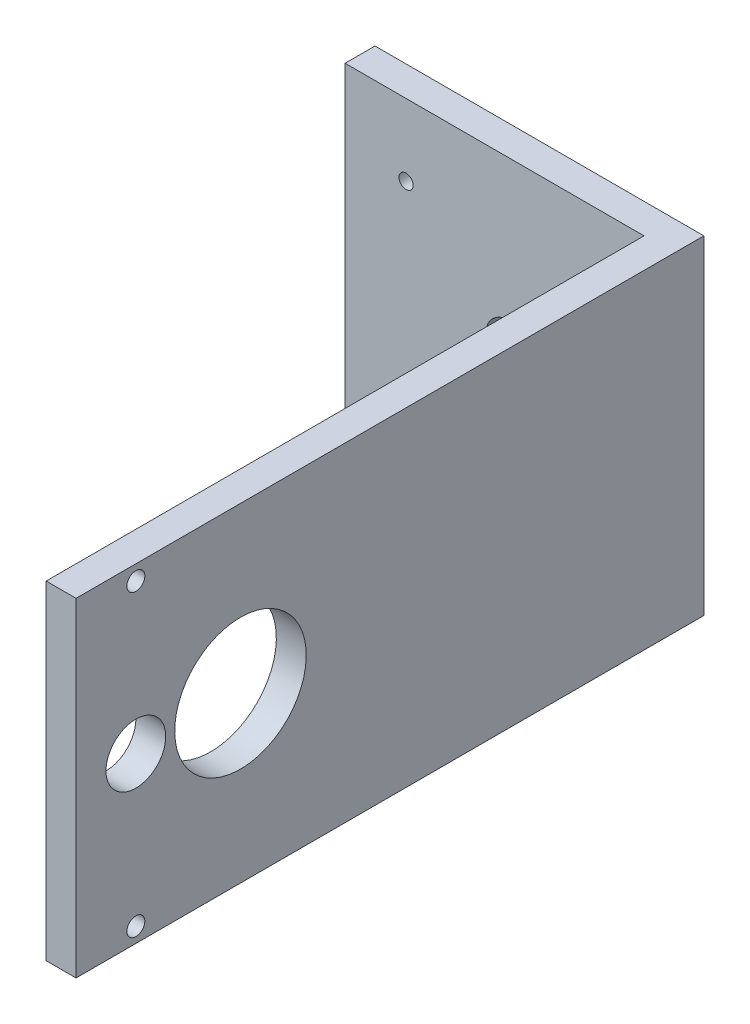
ISO-10303-21;
HEADER;
FILE_DESCRIPTION(('STEP AP214'),'2;1');
FILE_NAME('part.step','',(''),(''),'','','');
FILE_SCHEMA(('AUTOMOTIVE_DESIGN { 1 0 10303 214 1 1 1 1 }'));
ENDSEC;
DATA;
#1=APPLICATION_CONTEXT('core data for automotive mechanical design processes');
#2=APPLICATION_PROTOCOL_DEFINITION('international standard','automotive_design',2000,#1);
#3=PRODUCT_CONTEXT('',#1,'mechanical');
#4=PRODUCT('Part','Part','',(#3));
#5=PRODUCT_RELATED_PRODUCT_CATEGORY('part','',(#4));
#6=PRODUCT_DEFINITION_FORMATION('','',#4);
#7=PRODUCT_DEFINITION_CONTEXT('part definition',#1,'design');
#8=PRODUCT_DEFINITION('design','',#6,#7);
#9=PRODUCT_DEFINITION_SHAPE('','',#8);
#10=(LENGTH_UNIT() NAMED_UNIT(*) SI_UNIT(.MILLI.,.METRE.));
#11=(NAMED_UNIT(*) PLANE_ANGLE_UNIT() SI_UNIT($,.RADIAN.));
#12=(NAMED_UNIT(*) SI_UNIT($,.STERADIAN.) SOLID_ANGLE_UNIT());
#13=UNCERTAINTY_MEASURE_WITH_UNIT(LENGTH_MEASURE(1.E-05),#10,'distance_accuracy_value','');
#14=(GEOMETRIC_REPRESENTATION_CONTEXT(3) GLOBAL_UNCERTAINTY_ASSIGNED_CONTEXT((#13)) GLOBAL_UNIT_ASSIGNED_CONTEXT((#10,
#11,#12)) REPRESENTATION_CONTEXT('',''));
#15=CARTESIAN_POINT('',(0.,0.,0.));
#16=DIRECTION('',(0.,0.,1.));
#17=DIRECTION('',(1.,0.,0.));
#18=AXIS2_PLACEMENT_3D('',#15,#16,#17);
#19=CARTESIAN_POINT('',(27.5,27.5,5.));
#20=DIRECTION('',(-1.,0.,0.));
#21=DIRECTION('',(0.,-1.,0.));
#22=AXIS2_PLACEMENT_3D('',#19,#20,#21);
#23=PLANE('',#22);
#24=CARTESIAN_POINT('',(27.5,0.,77.5));
#25=DIRECTION('',(1.,0.,0.));
#26=DIRECTION('',(0.,1.,0.));
#27=AXIS2_PLACEMENT_3D('',#24,#25,#26);
#28=CIRCLE('',#27,11.);
#29=CARTESIAN_POINT('',(27.5,11.,77.5));
#30=VERTEX_POINT('',#29);
#31=EDGE_CURVE('E164',#30,#30,#28,.T.);
#32=ORIENTED_EDGE('',*,*,#31,.F.);
#33=EDGE_LOOP('',(#32));
#34=FACE_BOUND('',#33,.T.);
#35=CARTESIAN_POINT('',(27.5,-25.,95.));
#36=DIRECTION('',(1.,0.,0.));
#37=DIRECTION('',(0.,1.,0.));
#38=AXIS2_PLACEMENT_3D('',#35,#36,#37);
#39=CIRCLE('',#38,1.5);
#40=CARTESIAN_POINT('',(27.5,-23.5,95.));
#41=VERTEX_POINT('',#40);
#42=EDGE_CURVE('E158',#41,#41,#39,.T.);
#43=ORIENTED_EDGE('',*,*,#42,.F.);
#44=EDGE_LOOP('',(#43));
#45=FACE_BOUND('',#44,.T.);
#46=CARTESIAN_POINT('',(27.5,25.,95.));
#47=DIRECTION('',(1.,0.,0.));
#48=DIRECTION('',(0.,1.,0.));
#49=AXIS2_PLACEMENT_3D('',#46,#47,#48);
#50=CIRCLE('',#49,1.50000000000002);
#51=CARTESIAN_POINT('',(27.5,26.5,95.));
#52=VERTEX_POINT('',#51);
#53=EDGE_CURVE('E152',#52,#52,#50,.T.);
#54=ORIENTED_EDGE('',*,*,#53,.F.);
#55=EDGE_LOOP('',(#54));
#56=FACE_BOUND('',#55,.T.);
#57=CARTESIAN_POINT('',(27.5,0.,95.));
#58=DIRECTION('',(1.,0.,0.));
#59=DIRECTION('',(0.,1.,0.));
#60=AXIS2_PLACEMENT_3D('',#57,#58,#59);
#61=CIRCLE('',#60,5.);
#62=CARTESIAN_POINT('',(27.5,5.00000000000001,95.));
#63=VERTEX_POINT('',#62);
#64=EDGE_CURVE('E146',#63,#63,#61,.T.);
#65=ORIENTED_EDGE('',*,*,#64,.F.);
#66=EDGE_LOOP('',(#65));
#67=FACE_BOUND('',#66,.T.);
#68=DIRECTION('',(0.,1.,0.));
#69=VECTOR('',#68,1.);
#70=CARTESIAN_POINT('',(27.5,27.5,0.));
#71=LINE('',#70,#69);
#72=CARTESIAN_POINT('',(27.5,-27.5,0.));
#73=VERTEX_POINT('',#72);
#74=CARTESIAN_POINT('',(27.5,27.5,0.));
#75=VERTEX_POINT('',#74);
#76=EDGE_CURVE('E92',#73,#75,#71,.T.);
#77=ORIENTED_EDGE('',*,*,#76,.T.);
#78=DIRECTION('',(0.,0.,-1.));
#79=VECTOR('',#78,1.);
#80=CARTESIAN_POINT('',(27.5,27.5,5.));
#81=LINE('',#80,#79);
#82=CARTESIAN_POINT('',(27.5,27.5,105.));
#83=VERTEX_POINT('',#82);
#84=EDGE_CURVE('E11',#83,#75,#81,.T.);
#85=ORIENTED_EDGE('',*,*,#84,.F.);
#86=DIRECTION('',(0.,1.,0.));
#87=VECTOR('',#86,1.);
#88=CARTESIAN_POINT('',(27.5,27.5,105.));
#89=LINE('',#88,#87);
#90=CARTESIAN_POINT('',(27.5,-27.5,105.));
#91=VERTEX_POINT('',#90);
#92=EDGE_CURVE('E94',#91,#83,#89,.T.);
#93=ORIENTED_EDGE('',*,*,#92,.F.);
#94=DIRECTION('',(0.,0.,-1.));
#95=VECTOR('',#94,1.);
#96=CARTESIAN_POINT('',(27.5,-27.5,5.));
#97=LINE('',#96,#95);
#98=EDGE_CURVE('E78',#91,#73,#97,.T.);
#99=ORIENTED_EDGE('',*,*,#98,.T.);
#100=EDGE_LOOP('',(#77,#85,#93,#99));
#101=FACE_BOUND('',#100,.T.);
#102=ADVANCED_FACE('F32',(#34,#45,#56,#67,#101),#23,.F.);
#103=CARTESIAN_POINT('',(-27.5,27.5,5.));
#104=DIRECTION('',(0.,-1.,0.));
#105=DIRECTION('',(0.,0.,-1.));
#106=AXIS2_PLACEMENT_3D('',#103,#104,#105);
#107=PLANE('',#106);
#108=DIRECTION('',(-1.,0.,0.));
#109=VECTOR('',#108,1.);
#110=CARTESIAN_POINT('',(-27.5,27.5,0.));
#111=LINE('',#110,#109);
#112=CARTESIAN_POINT('',(-27.5,27.5,0.));
#113=VERTEX_POINT('',#112);
#114=EDGE_CURVE('E98',#75,#113,#111,.T.);
#115=ORIENTED_EDGE('',*,*,#114,.T.);
#116=DIRECTION('',(0.,0.,-1.));
#117=VECTOR('',#116,1.);
#118=CARTESIAN_POINT('',(-27.5,27.5,5.));
#119=LINE('',#118,#117);
#120=CARTESIAN_POINT('',(-27.5,27.5,5.));
#121=VERTEX_POINT('',#120);
#122=EDGE_CURVE('E40',#121,#113,#119,.T.);
#123=ORIENTED_EDGE('',*,*,#122,.F.);
#124=DIRECTION('',(-1.,0.,0.));
#125=VECTOR('',#124,1.);
#126=CARTESIAN_POINT('',(-27.5,27.5,5.));
#127=LINE('',#126,#125);
#128=CARTESIAN_POINT('',(22.5,27.5,5.));
#129=VERTEX_POINT('',#128);
#130=EDGE_CURVE('E85',#129,#121,#127,.T.);
#131=ORIENTED_EDGE('',*,*,#130,.F.);
#132=DIRECTION('',(0.,0.,-1.));
#133=VECTOR('',#132,1.);
#134=CARTESIAN_POINT('',(22.5,27.5,105.));
#135=LINE('',#134,#133);
#136=CARTESIAN_POINT('',(22.5,27.5,105.));
#137=VERTEX_POINT('',#136);
#138=EDGE_CURVE('E99',#137,#129,#135,.T.);
#139=ORIENTED_EDGE('',*,*,#138,.F.);
#140=DIRECTION('',(-1.,0.,0.));
#141=VECTOR('',#140,1.);
#142=CARTESIAN_POINT('',(27.5,27.5,105.));
#143=LINE('',#142,#141);
#144=EDGE_CURVE('E138',#83,#137,#143,.T.);
#145=ORIENTED_EDGE('',*,*,#144,.F.);
#146=ORIENTED_EDGE('',*,*,#84,.T.);
#147=EDGE_LOOP('',(#115,#123,#131,#139,#145,#146));
#148=FACE_BOUND('',#147,.T.);
#149=ADVANCED_FACE('F213',(#148),#107,.F.);
#150=CARTESIAN_POINT('',(-27.5,27.5,5.));
#151=DIRECTION('',(1.,0.,0.));
#152=DIRECTION('',(0.,1.,0.));
#153=AXIS2_PLACEMENT_3D('',#150,#151,#152);
#154=PLANE('',#153);
#155=DIRECTION('',(0.,-1.,0.));
#156=VECTOR('',#155,1.);
#157=CARTESIAN_POINT('',(-27.5,27.5,0.));
#158=LINE('',#157,#156);
#159=CARTESIAN_POINT('',(-27.5,-27.5,0.));
#160=VERTEX_POINT('',#159);
#161=EDGE_CURVE('E86',#113,#160,#158,.T.);
#162=ORIENTED_EDGE('',*,*,#161,.T.);
#163=DIRECTION('',(0.,0.,-1.));
#164=VECTOR('',#163,1.);
#165=CARTESIAN_POINT('',(-27.5,-27.5,5.));
#166=LINE('',#165,#164);
#167=CARTESIAN_POINT('',(-27.5,-27.5,5.));
#168=VERTEX_POINT('',#167);
#169=EDGE_CURVE('E81',#168,#160,#166,.T.);
#170=ORIENTED_EDGE('',*,*,#169,.F.);
#171=DIRECTION('',(0.,-1.,0.));
#172=VECTOR('',#171,1.);
#173=CARTESIAN_POINT('',(-27.5,27.5,5.));
#174=LINE('',#173,#172);
#175=EDGE_CURVE('E54',#121,#168,#174,.T.);
#176=ORIENTED_EDGE('',*,*,#175,.F.);
#177=ORIENTED_EDGE('',*,*,#122,.T.);
#178=EDGE_LOOP('',(#162,#170,#176,#177));
#179=FACE_BOUND('',#178,.T.);
#180=ADVANCED_FACE('F218',(#179),#154,.F.);
#181=CARTESIAN_POINT('',(-27.5,-27.5,5.));
#182=DIRECTION('',(0.,1.,0.));
#183=DIRECTION('',(0.,0.,1.));
#184=AXIS2_PLACEMENT_3D('',#181,#182,#183);
#185=PLANE('',#184);
#186=DIRECTION('',(1.,0.,0.));
#187=VECTOR('',#186,1.);
#188=CARTESIAN_POINT('',(-27.5,-27.5,0.));
#189=LINE('',#188,#187);
#190=EDGE_CURVE('E74',#160,#73,#189,.T.);
#191=ORIENTED_EDGE('',*,*,#190,.T.);
#192=ORIENTED_EDGE('',*,*,#98,.F.);
#193=DIRECTION('',(1.,0.,0.));
#194=VECTOR('',#193,1.);
#195=CARTESIAN_POINT('',(27.5,-27.5,105.));
#196=LINE('',#195,#194);
#197=CARTESIAN_POINT('',(22.5,-27.5,105.));
#198=VERTEX_POINT('',#197);
#199=EDGE_CURVE('E131',#198,#91,#196,.T.);
#200=ORIENTED_EDGE('',*,*,#199,.F.);
#201=DIRECTION('',(0.,0.,-1.));
#202=VECTOR('',#201,1.);
#203=CARTESIAN_POINT('',(22.5,-27.5,105.));
#204=LINE('',#203,#202);
#205=CARTESIAN_POINT('',(22.5,-27.5,5.));
#206=VERTEX_POINT('',#205);
#207=EDGE_CURVE('E103',#198,#206,#204,.T.);
#208=ORIENTED_EDGE('',*,*,#207,.T.);
#209=DIRECTION('',(1.,0.,0.));
#210=VECTOR('',#209,1.);
#211=CARTESIAN_POINT('',(-27.5,-27.5,5.));
#212=LINE('',#211,#210);
#213=EDGE_CURVE('E95',#168,#206,#212,.T.);
#214=ORIENTED_EDGE('',*,*,#213,.F.);
#215=ORIENTED_EDGE('',*,*,#169,.T.);
#216=EDGE_LOOP('',(#191,#192,#200,#208,#214,#215));
#217=FACE_BOUND('',#216,.T.);
#218=ADVANCED_FACE('F76',(#217),#185,.F.);
#219=CARTESIAN_POINT('',(0.,0.,5.));
#220=DIRECTION('',(0.,0.,1.));
#221=DIRECTION('',(1.,0.,0.));
#222=AXIS2_PLACEMENT_3D('',#219,#220,#221);
#223=PLANE('',#222);
#224=CARTESIAN_POINT('',(-17.3,15.5,5.));
#225=DIRECTION('',(0.,0.,1.));
#226=DIRECTION('',(1.,0.,0.));
#227=AXIS2_PLACEMENT_3D('',#224,#225,#226);
#228=CIRCLE('',#227,1.18744999999999);
#229=CARTESIAN_POINT('',(-16.11255,15.5,5.));
#230=VERTEX_POINT('',#229);
#231=EDGE_CURVE('E182',#230,#230,#228,.T.);
#232=ORIENTED_EDGE('',*,*,#231,.F.);
#233=EDGE_LOOP('',(#232));
#234=FACE_BOUND('',#233,.T.);
#235=CARTESIAN_POINT('',(-17.3,-15.5,5.));
#236=DIRECTION('',(0.,0.,1.));
#237=DIRECTION('',(1.,0.,0.));
#238=AXIS2_PLACEMENT_3D('',#235,#236,#237);
#239=CIRCLE('',#238,1.18744999999999);
#240=CARTESIAN_POINT('',(-16.11255,-15.5,5.));
#241=VERTEX_POINT('',#240);
#242=EDGE_CURVE('E176',#241,#241,#239,.T.);
#243=ORIENTED_EDGE('',*,*,#242,.F.);
#244=EDGE_LOOP('',(#243));
#245=FACE_BOUND('',#244,.T.);
#246=CARTESIAN_POINT('',(0.,0.,5.));
#247=DIRECTION('',(0.,0.,1.));
#248=DIRECTION('',(1.,0.,0.));
#249=AXIS2_PLACEMENT_3D('',#246,#247,#248);
#250=CIRCLE('',#249,4.);
#251=CARTESIAN_POINT('',(4.,0.,5.));
#252=VERTEX_POINT('',#251);
#253=EDGE_CURVE('E170',#252,#252,#250,.T.);
#254=ORIENTED_EDGE('',*,*,#253,.F.);
#255=EDGE_LOOP('',(#254));
#256=FACE_BOUND('',#255,.T.);
#257=DIRECTION('',(0.,-1.,0.));
#258=VECTOR('',#257,1.);
#259=CARTESIAN_POINT('',(22.5,27.5,5.));
#260=LINE('',#259,#258);
#261=EDGE_CURVE('E48',#129,#206,#260,.T.);
#262=ORIENTED_EDGE('',*,*,#261,.F.);
#263=ORIENTED_EDGE('',*,*,#130,.T.);
#264=ORIENTED_EDGE('',*,*,#175,.T.);
#265=ORIENTED_EDGE('',*,*,#213,.T.);
#266=EDGE_LOOP('',(#262,#263,#264,#265));
#267=FACE_BOUND('',#266,.T.);
#268=ADVANCED_FACE('F120',(#234,#245,#256,#267),#223,.T.);
#269=CARTESIAN_POINT('',(0.,0.,0.));
#270=DIRECTION('',(0.,0.,1.));
#271=DIRECTION('',(1.,0.,0.));
#272=AXIS2_PLACEMENT_3D('',#269,#270,#271);
#273=PLANE('',#272);
#274=CARTESIAN_POINT('',(0.,0.,0.));
#275=DIRECTION('',(0.,0.,1.));
#276=DIRECTION('',(1.,0.,0.));
#277=AXIS2_PLACEMENT_3D('',#274,#275,#276);
#278=CIRCLE('',#277,4.);
#279=CARTESIAN_POINT('',(4.,0.,0.));
#280=VERTEX_POINT('',#279);
#281=EDGE_CURVE('E167',#280,#280,#278,.F.);
#282=ORIENTED_EDGE('',*,*,#281,.F.);
#283=EDGE_LOOP('',(#282));
#284=FACE_BOUND('',#283,.T.);
#285=ORIENTED_EDGE('',*,*,#76,.F.);
#286=ORIENTED_EDGE('',*,*,#190,.F.);
#287=ORIENTED_EDGE('',*,*,#161,.F.);
#288=ORIENTED_EDGE('',*,*,#114,.F.);
#289=EDGE_LOOP('',(#285,#286,#287,#288));
#290=FACE_BOUND('',#289,.T.);
#291=ADVANCED_FACE('F97',(#284,#290),#273,.F.);
#292=CARTESIAN_POINT('',(22.5,27.5,105.));
#293=DIRECTION('',(1.,0.,0.));
#294=DIRECTION('',(0.,1.,0.));
#295=AXIS2_PLACEMENT_3D('',#292,#293,#294);
#296=PLANE('',#295);
#297=CARTESIAN_POINT('',(22.5,0.,77.5));
#298=DIRECTION('',(1.,0.,0.));
#299=DIRECTION('',(0.,1.,0.));
#300=AXIS2_PLACEMENT_3D('',#297,#298,#299);
#301=CIRCLE('',#300,11.);
#302=CARTESIAN_POINT('',(22.5,11.,77.5));
#303=VERTEX_POINT('',#302);
#304=EDGE_CURVE('E161',#303,#303,#301,.F.);
#305=ORIENTED_EDGE('',*,*,#304,.F.);
#306=EDGE_LOOP('',(#305));
#307=FACE_BOUND('',#306,.T.);
#308=CARTESIAN_POINT('',(22.5,-25.,95.));
#309=DIRECTION('',(1.,0.,0.));
#310=DIRECTION('',(0.,1.,0.));
#311=AXIS2_PLACEMENT_3D('',#308,#309,#310);
#312=CIRCLE('',#311,1.5);
#313=CARTESIAN_POINT('',(22.5,-23.5,95.));
#314=VERTEX_POINT('',#313);
#315=EDGE_CURVE('E155',#314,#314,#312,.F.);
#316=ORIENTED_EDGE('',*,*,#315,.F.);
#317=EDGE_LOOP('',(#316));
#318=FACE_BOUND('',#317,.T.);
#319=CARTESIAN_POINT('',(22.5,25.,95.));
#320=DIRECTION('',(1.,0.,0.));
#321=DIRECTION('',(0.,1.,0.));
#322=AXIS2_PLACEMENT_3D('',#319,#320,#321);
#323=CIRCLE('',#322,1.50000000000002);
#324=CARTESIAN_POINT('',(22.5,26.5,95.));
#325=VERTEX_POINT('',#324);
#326=EDGE_CURVE('E149',#325,#325,#323,.F.);
#327=ORIENTED_EDGE('',*,*,#326,.F.);
#328=EDGE_LOOP('',(#327));
#329=FACE_BOUND('',#328,.T.);
#330=CARTESIAN_POINT('',(22.5,0.,95.));
#331=DIRECTION('',(1.,0.,0.));
#332=DIRECTION('',(0.,1.,0.));
#333=AXIS2_PLACEMENT_3D('',#330,#331,#332);
#334=CIRCLE('',#333,5.);
#335=CARTESIAN_POINT('',(22.5,5.00000000000001,95.));
#336=VERTEX_POINT('',#335);
#337=EDGE_CURVE('E130',#336,#336,#334,.F.);
#338=ORIENTED_EDGE('',*,*,#337,.F.);
#339=EDGE_LOOP('',(#338));
#340=FACE_BOUND('',#339,.T.);
#341=ORIENTED_EDGE('',*,*,#261,.T.);
#342=ORIENTED_EDGE('',*,*,#207,.F.);
#343=DIRECTION('',(0.,-1.,0.));
#344=VECTOR('',#343,1.);
#345=CARTESIAN_POINT('',(22.5,27.5,105.));
#346=LINE('',#345,#344);
#347=EDGE_CURVE('E133',#137,#198,#346,.T.);
#348=ORIENTED_EDGE('',*,*,#347,.F.);
#349=ORIENTED_EDGE('',*,*,#138,.T.);
#350=EDGE_LOOP('',(#341,#342,#348,#349));
#351=FACE_BOUND('',#350,.T.);
#352=ADVANCED_FACE('F126',(#307,#318,#329,#340,#351),#296,.F.);
#353=CARTESIAN_POINT('',(0.,0.,105.));
#354=DIRECTION('',(0.,0.,-1.));
#355=DIRECTION('',(-1.,0.,0.));
#356=AXIS2_PLACEMENT_3D('',#353,#354,#355);
#357=PLANE('',#356);
#358=ORIENTED_EDGE('',*,*,#92,.T.);
#359=ORIENTED_EDGE('',*,*,#144,.T.);
#360=ORIENTED_EDGE('',*,*,#347,.T.);
#361=ORIENTED_EDGE('',*,*,#199,.T.);
#362=EDGE_LOOP('',(#358,#359,#360,#361));
#363=FACE_BOUND('',#362,.T.);
#364=ADVANCED_FACE('F208',(#363),#357,.F.);
#365=CARTESIAN_POINT('',(-27.501025,0.,95.));
#366=DIRECTION('',(1.,0.,0.));
#367=DIRECTION('',(0.,1.,0.));
#368=AXIS2_PLACEMENT_3D('',#365,#366,#367);
#369=CYLINDRICAL_SURFACE('',#368,5.);
#370=ORIENTED_EDGE('',*,*,#64,.T.);
#371=EDGE_LOOP('',(#370));
#372=FACE_BOUND('',#371,.T.);
#373=ORIENTED_EDGE('',*,*,#337,.T.);
#374=EDGE_LOOP('',(#373));
#375=FACE_BOUND('',#374,.T.);
#376=ADVANCED_FACE('F228',(#372,#375),#369,.F.);
#377=CARTESIAN_POINT('',(-27.501025,25.,95.));
#378=DIRECTION('',(1.,0.,0.));
#379=DIRECTION('',(0.,1.,0.));
#380=AXIS2_PLACEMENT_3D('',#377,#378,#379);
#381=CYLINDRICAL_SURFACE('',#380,1.50000000000002);
#382=ORIENTED_EDGE('',*,*,#53,.T.);
#383=EDGE_LOOP('',(#382));
#384=FACE_BOUND('',#383,.T.);
#385=ORIENTED_EDGE('',*,*,#326,.T.);
#386=EDGE_LOOP('',(#385));
#387=FACE_BOUND('',#386,.T.);
#388=ADVANCED_FACE('F231',(#384,#387),#381,.F.);
#389=CARTESIAN_POINT('',(-27.501025,-25.,95.));
#390=DIRECTION('',(1.,0.,0.));
#391=DIRECTION('',(0.,1.,0.));
#392=AXIS2_PLACEMENT_3D('',#389,#390,#391);
#393=CYLINDRICAL_SURFACE('',#392,1.5);
#394=ORIENTED_EDGE('',*,*,#42,.T.);
#395=EDGE_LOOP('',(#394));
#396=FACE_BOUND('',#395,.T.);
#397=ORIENTED_EDGE('',*,*,#315,.T.);
#398=EDGE_LOOP('',(#397));
#399=FACE_BOUND('',#398,.T.);
#400=ADVANCED_FACE('F239',(#396,#399),#393,.F.);
#401=CARTESIAN_POINT('',(-27.501025,0.,77.5));
#402=DIRECTION('',(1.,0.,0.));
#403=DIRECTION('',(0.,1.,0.));
#404=AXIS2_PLACEMENT_3D('',#401,#402,#403);
#405=CYLINDRICAL_SURFACE('',#404,11.);
#406=ORIENTED_EDGE('',*,*,#31,.T.);
#407=EDGE_LOOP('',(#406));
#408=FACE_BOUND('',#407,.T.);
#409=ORIENTED_EDGE('',*,*,#304,.T.);
#410=EDGE_LOOP('',(#409));
#411=FACE_BOUND('',#410,.T.);
#412=ADVANCED_FACE('F199',(#408,#411),#405,.F.);
#413=CARTESIAN_POINT('',(0.,0.,-0.00100000000000013));
#414=DIRECTION('',(0.,0.,1.));
#415=DIRECTION('',(1.,0.,0.));
#416=AXIS2_PLACEMENT_3D('',#413,#414,#415);
#417=CYLINDRICAL_SURFACE('',#416,4.);
#418=ORIENTED_EDGE('',*,*,#253,.T.);
#419=EDGE_LOOP('',(#418));
#420=FACE_BOUND('',#419,.T.);
#421=ORIENTED_EDGE('',*,*,#281,.T.);
#422=EDGE_LOOP('',(#421));
#423=FACE_BOUND('',#422,.T.);
#424=ADVANCED_FACE('F195',(#420,#423),#417,.F.);
#425=CARTESIAN_POINT('',(-17.3,-15.5,1.5));
#426=DIRECTION('',(0.,0.,1.));
#427=DIRECTION('',(1.,0.,0.));
#428=AXIS2_PLACEMENT_3D('',#425,#426,#427);
#429=CONICAL_SURFACE('',#428,1.18745,1.02974425867665);
#430=CARTESIAN_POINT('',(-17.3,-15.5,0.786508057935724));
#431=VERTEX_POINT('',#430);
#432=VERTEX_LOOP('',#431);
#433=FACE_BOUND('',#432,.T.);
#434=CARTESIAN_POINT('',(-17.3,-15.5,1.5));
#435=DIRECTION('',(0.,0.,1.));
#436=DIRECTION('',(1.,0.,0.));
#437=AXIS2_PLACEMENT_3D('',#434,#435,#436);
#438=CIRCLE('',#437,1.18745);
#439=CARTESIAN_POINT('',(-16.11255,-15.5,1.5));
#440=VERTEX_POINT('',#439);
#441=EDGE_CURVE('E173',#440,#440,#438,.T.);
#442=ORIENTED_EDGE('',*,*,#441,.T.);
#443=EDGE_LOOP('',(#442));
#444=FACE_BOUND('',#443,.T.);
#445=ADVANCED_FACE('F198',(#433,#444),#429,.F.);
#446=CARTESIAN_POINT('',(-17.3,-15.5,5.));
#447=DIRECTION('',(0.,0.,1.));
#448=DIRECTION('',(1.,0.,0.));
#449=AXIS2_PLACEMENT_3D('',#446,#447,#448);
#450=CYLINDRICAL_SURFACE('',#449,1.18744999999999);
#451=ORIENTED_EDGE('',*,*,#441,.F.);
#452=EDGE_LOOP('',(#451));
#453=FACE_BOUND('',#452,.T.);
#454=ORIENTED_EDGE('',*,*,#242,.T.);
#455=EDGE_LOOP('',(#454));
#456=FACE_BOUND('',#455,.T.);
#457=ADVANCED_FACE('F252',(#453,#456),#450,.F.);
#458=CARTESIAN_POINT('',(-17.3,15.5,1.5));
#459=DIRECTION('',(0.,0.,1.));
#460=DIRECTION('',(1.,0.,0.));
#461=AXIS2_PLACEMENT_3D('',#458,#459,#460);
#462=CONICAL_SURFACE('',#461,1.18745,1.02974425867665);
#463=CARTESIAN_POINT('',(-17.3,15.5,0.786508057935724));
#464=VERTEX_POINT('',#463);
#465=VERTEX_LOOP('',#464);
#466=FACE_BOUND('',#465,.T.);
#467=CARTESIAN_POINT('',(-17.3,15.5,1.5));
#468=DIRECTION('',(0.,0.,1.));
#469=DIRECTION('',(1.,0.,0.));
#470=AXIS2_PLACEMENT_3D('',#467,#468,#469);
#471=CIRCLE('',#470,1.18745);
#472=CARTESIAN_POINT('',(-16.11255,15.5,1.5));
#473=VERTEX_POINT('',#472);
#474=EDGE_CURVE('E179',#473,#473,#471,.T.);
#475=ORIENTED_EDGE('',*,*,#474,.T.);
#476=EDGE_LOOP('',(#475));
#477=FACE_BOUND('',#476,.T.);
#478=ADVANCED_FACE('F256',(#466,#477),#462,.F.);
#479=CARTESIAN_POINT('',(-17.3,15.5,5.));
#480=DIRECTION('',(0.,0.,1.));
#481=DIRECTION('',(1.,0.,0.));
#482=AXIS2_PLACEMENT_3D('',#479,#480,#481);
#483=CYLINDRICAL_SURFACE('',#482,1.18744999999999);
#484=ORIENTED_EDGE('',*,*,#474,.F.);
#485=EDGE_LOOP('',(#484));
#486=FACE_BOUND('',#485,.T.);
#487=ORIENTED_EDGE('',*,*,#231,.T.);
#488=EDGE_LOOP('',(#487));
#489=FACE_BOUND('',#488,.T.);
#490=ADVANCED_FACE('F186',(#486,#489),#483,.F.);
#491=CLOSED_SHELL('',(#102,#149,#180,#218,#268,#291,#352,#364,#376,#388,#400,#412,#424,#445,
#457,#478,#490));
#492=MANIFOLD_SOLID_BREP('B2',#491);
#493=ADVANCED_BREP_SHAPE_REPRESENTATION('',(#18,#492),#14);
#494=SHAPE_DEFINITION_REPRESENTATION(#9,#493);
ENDSEC;
END-ISO-10303-21;
